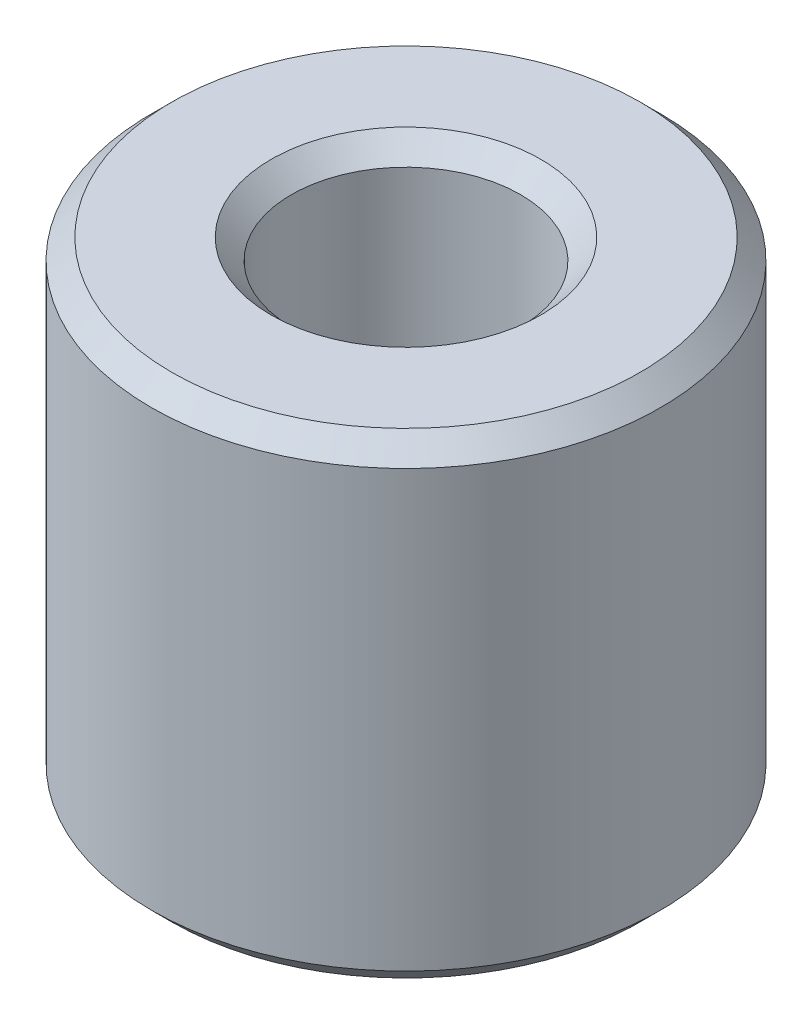
ISO-10303-21;
HEADER;
FILE_DESCRIPTION(('STEP AP214'),'2;1');
FILE_NAME('part.step','',(''),(''),'','','');
FILE_SCHEMA(('AUTOMOTIVE_DESIGN { 1 0 10303 214 1 1 1 1 }'));
ENDSEC;
DATA;
#1=APPLICATION_CONTEXT('core data for automotive mechanical design processes');
#2=APPLICATION_PROTOCOL_DEFINITION('international standard','automotive_design',2000,#1);
#3=PRODUCT_CONTEXT('',#1,'mechanical');
#4=PRODUCT('Part','Part','',(#3));
#5=PRODUCT_RELATED_PRODUCT_CATEGORY('part','',(#4));
#6=PRODUCT_DEFINITION_FORMATION('','',#4);
#7=PRODUCT_DEFINITION_CONTEXT('part definition',#1,'design');
#8=PRODUCT_DEFINITION('design','',#6,#7);
#9=PRODUCT_DEFINITION_SHAPE('','',#8);
#10=(LENGTH_UNIT() NAMED_UNIT(*) SI_UNIT(.MILLI.,.METRE.));
#11=(NAMED_UNIT(*) PLANE_ANGLE_UNIT() SI_UNIT($,.RADIAN.));
#12=(NAMED_UNIT(*) SI_UNIT($,.STERADIAN.) SOLID_ANGLE_UNIT());
#13=UNCERTAINTY_MEASURE_WITH_UNIT(LENGTH_MEASURE(1.E-05),#10,'distance_accuracy_value','');
#14=(GEOMETRIC_REPRESENTATION_CONTEXT(3) GLOBAL_UNCERTAINTY_ASSIGNED_CONTEXT((#13)) GLOBAL_UNIT_ASSIGNED_CONTEXT((#10,
#11,#12)) REPRESENTATION_CONTEXT('',''));
#15=CARTESIAN_POINT('',(0.,0.,0.));
#16=DIRECTION('',(0.,0.,1.));
#17=DIRECTION('',(1.,0.,0.));
#18=AXIS2_PLACEMENT_3D('',#15,#16,#17);
#19=CARTESIAN_POINT('',(0.,18.7,0.));
#20=DIRECTION('',(0.,1.,0.));
#21=DIRECTION('',(0.,0.,1.00000000000001));
#22=AXIS2_PLACEMENT_3D('',#19,#20,#21);
#23=PLANE('',#22);
#24=CARTESIAN_POINT('',(0.,18.7,0.));
#25=DIRECTION('',(0.,1.,0.));
#26=DIRECTION('',(0.,0.,1.00000000000001));
#27=AXIS2_PLACEMENT_3D('',#24,#25,#26);
#28=CIRCLE('',#27,9.2);
#29=CARTESIAN_POINT('',(0.,18.7,9.20000000000013));
#30=VERTEX_POINT('',#29);
#31=EDGE_CURVE('E12',#30,#30,#28,.T.);
#32=ORIENTED_EDGE('',*,*,#31,.T.);
#33=EDGE_LOOP('',(#32));
#34=FACE_BOUND('',#33,.T.);
#35=CARTESIAN_POINT('',(0.,18.7,0.));
#36=DIRECTION('',(0.,1.,0.));
#37=DIRECTION('',(0.,0.,1.00000000000001));
#38=AXIS2_PLACEMENT_3D('',#35,#36,#37);
#39=CIRCLE('',#38,5.3);
#40=CARTESIAN_POINT('',(0.,18.7,5.30000000000008));
#41=VERTEX_POINT('',#40);
#42=EDGE_CURVE('E55',#41,#41,#39,.F.);
#43=ORIENTED_EDGE('',*,*,#42,.T.);
#44=EDGE_LOOP('',(#43));
#45=FACE_BOUND('',#44,.T.);
#46=ADVANCED_FACE('F48',(#34,#45),#23,.T.);
#47=CARTESIAN_POINT('',(0.,0.,0.));
#48=DIRECTION('',(0.,1.,0.));
#49=DIRECTION('',(0.,0.,1.00000000000001));
#50=AXIS2_PLACEMENT_3D('',#47,#48,#49);
#51=PLANE('',#50);
#52=CARTESIAN_POINT('',(0.,0.,0.));
#53=DIRECTION('',(0.,1.,0.));
#54=DIRECTION('',(0.,0.,1.00000000000001));
#55=AXIS2_PLACEMENT_3D('',#52,#53,#54);
#56=CIRCLE('',#55,9.2);
#57=CARTESIAN_POINT('',(0.,0.,9.20000000000014));
#58=VERTEX_POINT('',#57);
#59=EDGE_CURVE('E68',#58,#58,#56,.F.);
#60=ORIENTED_EDGE('',*,*,#59,.T.);
#61=EDGE_LOOP('',(#60));
#62=FACE_BOUND('',#61,.T.);
#63=CARTESIAN_POINT('',(0.,0.,0.));
#64=DIRECTION('',(0.,1.,0.));
#65=DIRECTION('',(0.,0.,1.00000000000001));
#66=AXIS2_PLACEMENT_3D('',#63,#64,#65);
#67=CIRCLE('',#66,5.3);
#68=CARTESIAN_POINT('',(0.,0.,5.30000000000008));
#69=VERTEX_POINT('',#68);
#70=EDGE_CURVE('E71',#69,#69,#67,.T.);
#71=ORIENTED_EDGE('',*,*,#70,.T.);
#72=EDGE_LOOP('',(#71));
#73=FACE_BOUND('',#72,.T.);
#74=ADVANCED_FACE('F96',(#62,#73),#51,.F.);
#75=CARTESIAN_POINT('',(0.,18.7,0.));
#76=DIRECTION('',(0.,-1.,0.));
#77=DIRECTION('',(0.,0.,-1.00000000000001));
#78=AXIS2_PLACEMENT_3D('',#75,#76,#77);
#79=CYLINDRICAL_SURFACE('',#78,10.);
#80=CARTESIAN_POINT('',(0.,0.799999999999995,0.));
#81=DIRECTION('',(0.,1.,0.));
#82=DIRECTION('',(0.,0.,1.00000000000001));
#83=AXIS2_PLACEMENT_3D('',#80,#81,#82);
#84=CIRCLE('',#83,10.);
#85=CARTESIAN_POINT('',(0.,0.799999999999995,10.0000000000001));
#86=VERTEX_POINT('',#85);
#87=EDGE_CURVE('E74',#86,#86,#84,.T.);
#88=ORIENTED_EDGE('',*,*,#87,.T.);
#89=EDGE_LOOP('',(#88));
#90=FACE_BOUND('',#89,.T.);
#91=CARTESIAN_POINT('',(0.,17.9,0.));
#92=DIRECTION('',(0.,1.,0.));
#93=DIRECTION('',(0.,0.,1.00000000000001));
#94=AXIS2_PLACEMENT_3D('',#91,#92,#93);
#95=CIRCLE('',#94,10.);
#96=CARTESIAN_POINT('',(0.,17.9,10.0000000000001));
#97=VERTEX_POINT('',#96);
#98=EDGE_CURVE('E77',#97,#97,#95,.F.);
#99=ORIENTED_EDGE('',*,*,#98,.T.);
#100=EDGE_LOOP('',(#99));
#101=FACE_BOUND('',#100,.T.);
#102=ADVANCED_FACE('F81',(#90,#101),#79,.T.);
#103=CARTESIAN_POINT('',(0.,18.7,0.));
#104=DIRECTION('',(0.,-1.,0.));
#105=DIRECTION('',(0.,0.,-1.00000000000001));
#106=AXIS2_PLACEMENT_3D('',#103,#104,#105);
#107=CYLINDRICAL_SURFACE('',#106,4.5);
#108=CARTESIAN_POINT('',(0.,0.799999999999995,0.));
#109=DIRECTION('',(0.,1.,0.));
#110=DIRECTION('',(0.,0.,1.00000000000001));
#111=AXIS2_PLACEMENT_3D('',#108,#109,#110);
#112=CIRCLE('',#111,4.5);
#113=CARTESIAN_POINT('',(0.,0.799999999999995,4.50000000000006));
#114=VERTEX_POINT('',#113);
#115=EDGE_CURVE('E59',#114,#114,#112,.F.);
#116=ORIENTED_EDGE('',*,*,#115,.T.);
#117=EDGE_LOOP('',(#116));
#118=FACE_BOUND('',#117,.T.);
#119=CARTESIAN_POINT('',(0.,17.9,0.));
#120=DIRECTION('',(0.,1.,0.));
#121=DIRECTION('',(0.,0.,1.00000000000001));
#122=AXIS2_PLACEMENT_3D('',#119,#120,#121);
#123=CIRCLE('',#122,4.5);
#124=CARTESIAN_POINT('',(0.,17.9,4.50000000000006));
#125=VERTEX_POINT('',#124);
#126=EDGE_CURVE('E63',#125,#125,#123,.T.);
#127=ORIENTED_EDGE('',*,*,#126,.T.);
#128=EDGE_LOOP('',(#127));
#129=FACE_BOUND('',#128,.T.);
#130=ADVANCED_FACE('F104',(#118,#129),#107,.F.);
#131=CARTESIAN_POINT('',(0.,0.799999999999995,0.));
#132=DIRECTION('',(0.,1.,0.));
#133=DIRECTION('',(0.,0.,1.00000000000001));
#134=AXIS2_PLACEMENT_3D('',#131,#132,#133);
#135=CONICAL_SURFACE('',#134,10.,0.78539816339745);
#136=ORIENTED_EDGE('',*,*,#59,.F.);
#137=EDGE_LOOP('',(#136));
#138=FACE_BOUND('',#137,.T.);
#139=ORIENTED_EDGE('',*,*,#87,.F.);
#140=EDGE_LOOP('',(#139));
#141=FACE_BOUND('',#140,.T.);
#142=ADVANCED_FACE('F92',(#138,#141),#135,.T.);
#143=CARTESIAN_POINT('',(0.,0.,0.));
#144=DIRECTION('',(0.,-1.,0.));
#145=DIRECTION('',(0.,0.,-1.00000000000001));
#146=AXIS2_PLACEMENT_3D('',#143,#144,#145);
#147=CONICAL_SURFACE('',#146,5.3,0.785398163397447);
#148=ORIENTED_EDGE('',*,*,#115,.F.);
#149=EDGE_LOOP('',(#148));
#150=FACE_BOUND('',#149,.T.);
#151=ORIENTED_EDGE('',*,*,#70,.F.);
#152=EDGE_LOOP('',(#151));
#153=FACE_BOUND('',#152,.T.);
#154=ADVANCED_FACE('F86',(#150,#153),#147,.F.);
#155=CARTESIAN_POINT('',(0.,18.7,0.));
#156=DIRECTION('',(0.,-1.,0.));
#157=DIRECTION('',(0.,0.,-1.00000000000001));
#158=AXIS2_PLACEMENT_3D('',#155,#156,#157);
#159=CONICAL_SURFACE('',#158,9.2,0.785398163397445);
#160=ORIENTED_EDGE('',*,*,#98,.F.);
#161=EDGE_LOOP('',(#160));
#162=FACE_BOUND('',#161,.T.);
#163=ORIENTED_EDGE('',*,*,#31,.F.);
#164=EDGE_LOOP('',(#163));
#165=FACE_BOUND('',#164,.T.);
#166=ADVANCED_FACE('F83',(#162,#165),#159,.T.);
#167=CARTESIAN_POINT('',(0.,17.9,0.));
#168=DIRECTION('',(0.,1.,0.));
#169=DIRECTION('',(0.,0.,1.00000000000001));
#170=AXIS2_PLACEMENT_3D('',#167,#168,#169);
#171=CONICAL_SURFACE('',#170,4.5,0.785398163397452);
#172=ORIENTED_EDGE('',*,*,#42,.F.);
#173=EDGE_LOOP('',(#172));
#174=FACE_BOUND('',#173,.T.);
#175=ORIENTED_EDGE('',*,*,#126,.F.);
#176=EDGE_LOOP('',(#175));
#177=FACE_BOUND('',#176,.T.);
#178=ADVANCED_FACE('F50',(#174,#177),#171,.F.);
#179=CLOSED_SHELL('',(#46,#74,#102,#130,#142,#154,#166,#178));
#180=MANIFOLD_SOLID_BREP('B2',#179);
#181=ADVANCED_BREP_SHAPE_REPRESENTATION('',(#18,#180),#14);
#182=SHAPE_DEFINITION_REPRESENTATION(#9,#181);
ENDSEC;
END-ISO-10303-21;
